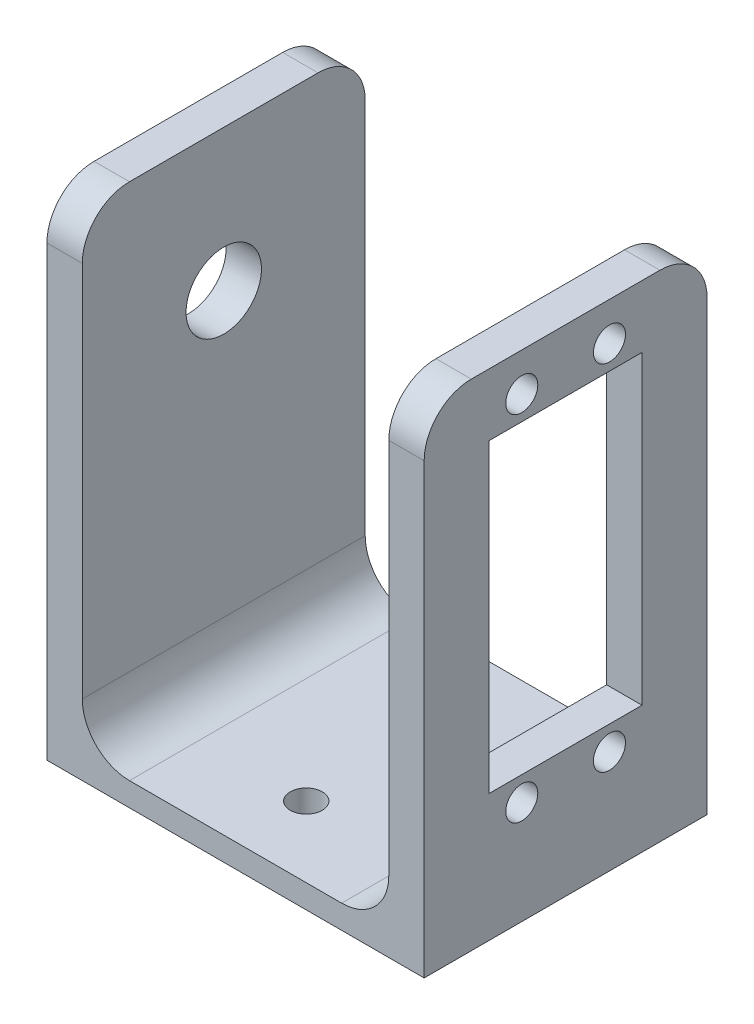
ISO-10303-21;
HEADER;
FILE_DESCRIPTION(('STEP AP214'),'2;1');
FILE_NAME('part.step','',(''),(''),'','','');
FILE_SCHEMA(('AUTOMOTIVE_DESIGN { 1 0 10303 214 1 1 1 1 }'));
ENDSEC;
DATA;
#1=APPLICATION_CONTEXT('core data for automotive mechanical design processes');
#2=APPLICATION_PROTOCOL_DEFINITION('international standard','automotive_design',2000,#1);
#3=PRODUCT_CONTEXT('',#1,'mechanical');
#4=PRODUCT('Part','Part','',(#3));
#5=PRODUCT_RELATED_PRODUCT_CATEGORY('part','',(#4));
#6=PRODUCT_DEFINITION_FORMATION('','',#4);
#7=PRODUCT_DEFINITION_CONTEXT('part definition',#1,'design');
#8=PRODUCT_DEFINITION('design','',#6,#7);
#9=PRODUCT_DEFINITION_SHAPE('','',#8);
#10=(LENGTH_UNIT() NAMED_UNIT(*) SI_UNIT(.MILLI.,.METRE.));
#11=(NAMED_UNIT(*) PLANE_ANGLE_UNIT() SI_UNIT($,.RADIAN.));
#12=(NAMED_UNIT(*) SI_UNIT($,.STERADIAN.) SOLID_ANGLE_UNIT());
#13=UNCERTAINTY_MEASURE_WITH_UNIT(LENGTH_MEASURE(1.E-05),#10,'distance_accuracy_value','');
#14=(GEOMETRIC_REPRESENTATION_CONTEXT(3) GLOBAL_UNCERTAINTY_ASSIGNED_CONTEXT((#13)) GLOBAL_UNIT_ASSIGNED_CONTEXT((#10,
#11,#12)) REPRESENTATION_CONTEXT('',''));
#15=CARTESIAN_POINT('',(0.,0.,0.));
#16=DIRECTION('',(0.,0.,1.));
#17=DIRECTION('',(1.,0.,0.));
#18=AXIS2_PLACEMENT_3D('',#15,#16,#17);
#19=CARTESIAN_POINT('',(0.,3.175,0.));
#20=DIRECTION('',(0.,-1.,0.));
#21=DIRECTION('',(0.,0.,-1.));
#22=AXIS2_PLACEMENT_3D('',#19,#20,#21);
#23=PLANE('',#22);
#24=CARTESIAN_POINT('',(25.4,3.175,-28.575));
#25=DIRECTION('',(0.,1.,0.));
#26=DIRECTION('',(0.,0.,1.));
#27=AXIS2_PLACEMENT_3D('',#24,#25,#26);
#28=CIRCLE('',#27,2.159);
#29=CARTESIAN_POINT('',(25.4,3.175,-26.416));
#30=VERTEX_POINT('',#29);
#31=EDGE_CURVE('E628',#30,#30,#28,.T.);
#32=ORIENTED_EDGE('',*,*,#31,.F.);
#33=EDGE_LOOP('',(#32));
#34=FACE_BOUND('',#33,.T.);
#35=CARTESIAN_POINT('',(25.4,3.175,-9.525));
#36=DIRECTION('',(0.,1.,0.));
#37=DIRECTION('',(0.,0.,1.));
#38=AXIS2_PLACEMENT_3D('',#35,#36,#37);
#39=CIRCLE('',#38,2.159);
#40=CARTESIAN_POINT('',(25.4,3.175,-7.366));
#41=VERTEX_POINT('',#40);
#42=EDGE_CURVE('E624',#41,#41,#39,.T.);
#43=ORIENTED_EDGE('',*,*,#42,.F.);
#44=EDGE_LOOP('',(#43));
#45=FACE_BOUND('',#44,.T.);
#46=DIRECTION('',(-1.,0.,0.));
#47=VECTOR('',#46,1.);
#48=CARTESIAN_POINT('',(0.,3.175,-38.1));
#49=LINE('',#48,#47);
#50=CARTESIAN_POINT('',(39.6875,3.175,-38.1));
#51=VERTEX_POINT('',#50);
#52=CARTESIAN_POINT('',(11.1125,3.175,-38.1));
#53=VERTEX_POINT('',#52);
#54=EDGE_CURVE('E224',#51,#53,#49,.T.);
#55=ORIENTED_EDGE('',*,*,#54,.T.);
#56=DIRECTION('',(0.,0.,-1.));
#57=VECTOR('',#56,1.);
#58=CARTESIAN_POINT('',(11.1125,3.175,0.));
#59=LINE('',#58,#57);
#60=CARTESIAN_POINT('',(11.1125,3.175,0.));
#61=VERTEX_POINT('',#60);
#62=EDGE_CURVE('E290',#53,#61,#59,.F.);
#63=ORIENTED_EDGE('',*,*,#62,.T.);
#64=DIRECTION('',(1.,0.,0.));
#65=VECTOR('',#64,1.);
#66=CARTESIAN_POINT('',(0.,3.175,0.));
#67=LINE('',#66,#65);
#68=CARTESIAN_POINT('',(39.6875,3.175,0.));
#69=VERTEX_POINT('',#68);
#70=EDGE_CURVE('E221',#61,#69,#67,.T.);
#71=ORIENTED_EDGE('',*,*,#70,.T.);
#72=DIRECTION('',(0.,0.,1.));
#73=VECTOR('',#72,1.);
#74=CARTESIAN_POINT('',(39.6875,3.175,-38.1));
#75=LINE('',#74,#73);
#76=EDGE_CURVE('E288',#69,#51,#75,.F.);
#77=ORIENTED_EDGE('',*,*,#76,.T.);
#78=EDGE_LOOP('',(#55,#63,#71,#77));
#79=FACE_BOUND('',#78,.T.);
#80=ADVANCED_FACE('F36',(#34,#45,#79),#23,.F.);
#81=CARTESIAN_POINT('',(0.,3.175,0.));
#82=DIRECTION('',(1.,0.,0.));
#83=DIRECTION('',(0.,0.,-1.));
#84=AXIS2_PLACEMENT_3D('',#81,#82,#83);
#85=PLANE('',#84);
#86=CARTESIAN_POINT('',(0.,47.625,-19.05));
#87=DIRECTION('',(-1.,0.,0.));
#88=DIRECTION('',(0.,0.,1.));
#89=AXIS2_PLACEMENT_3D('',#86,#87,#88);
#90=CIRCLE('',#89,5.08);
#91=CARTESIAN_POINT('',(0.,47.625,-13.97));
#92=VERTEX_POINT('',#91);
#93=EDGE_CURVE('E617',#92,#92,#90,.T.);
#94=ORIENTED_EDGE('',*,*,#93,.F.);
#95=EDGE_LOOP('',(#94));
#96=FACE_BOUND('',#95,.T.);
#97=DIRECTION('',(0.,0.,1.));
#98=VECTOR('',#97,1.);
#99=CARTESIAN_POINT('',(0.,66.675,-38.1));
#100=LINE('',#99,#98);
#101=CARTESIAN_POINT('',(0.,66.675,-31.75));
#102=VERTEX_POINT('',#101);
#103=CARTESIAN_POINT('',(0.,66.675,-6.35000000000002));
#104=VERTEX_POINT('',#103);
#105=EDGE_CURVE('E199',#102,#104,#100,.T.);
#106=ORIENTED_EDGE('',*,*,#105,.F.);
#107=CARTESIAN_POINT('',(0.,60.325,-31.75));
#108=DIRECTION('',(1.,0.,0.));
#109=DIRECTION('',(0.,0.,-1.));
#110=AXIS2_PLACEMENT_3D('',#107,#108,#109);
#111=CIRCLE('',#110,6.35);
#112=CARTESIAN_POINT('',(0.,60.325,-38.1));
#113=VERTEX_POINT('',#112);
#114=EDGE_CURVE('E279',#102,#113,#111,.F.);
#115=ORIENTED_EDGE('',*,*,#114,.T.);
#116=DIRECTION('',(0.,-1.,0.));
#117=VECTOR('',#116,1.);
#118=CARTESIAN_POINT('',(0.,3.175,-38.1));
#119=LINE('',#118,#117);
#120=CARTESIAN_POINT('',(0.,0.,-38.1));
#121=VERTEX_POINT('',#120);
#122=EDGE_CURVE('E228',#113,#121,#119,.T.);
#123=ORIENTED_EDGE('',*,*,#122,.T.);
#124=DIRECTION('',(0.,0.,1.));
#125=VECTOR('',#124,1.);
#126=CARTESIAN_POINT('',(0.,0.,0.));
#127=LINE('',#126,#125);
#128=CARTESIAN_POINT('',(0.,0.,0.));
#129=VERTEX_POINT('',#128);
#130=EDGE_CURVE('E220',#121,#129,#127,.T.);
#131=ORIENTED_EDGE('',*,*,#130,.T.);
#132=DIRECTION('',(0.,-1.,0.));
#133=VECTOR('',#132,1.);
#134=CARTESIAN_POINT('',(0.,3.175,0.));
#135=LINE('',#134,#133);
#136=CARTESIAN_POINT('',(0.,60.325,0.));
#137=VERTEX_POINT('',#136);
#138=EDGE_CURVE('E244',#137,#129,#135,.T.);
#139=ORIENTED_EDGE('',*,*,#138,.F.);
#140=CARTESIAN_POINT('',(0.,60.325,-6.35));
#141=DIRECTION('',(1.,0.,0.));
#142=DIRECTION('',(0.,0.,-1.));
#143=AXIS2_PLACEMENT_3D('',#140,#141,#142);
#144=CIRCLE('',#143,6.35);
#145=EDGE_CURVE('E277',#137,#104,#144,.F.);
#146=ORIENTED_EDGE('',*,*,#145,.T.);
#147=EDGE_LOOP('',(#106,#115,#123,#131,#139,#146));
#148=FACE_BOUND('',#147,.T.);
#149=ADVANCED_FACE('F335',(#96,#148),#85,.F.);
#150=CARTESIAN_POINT('',(0.,3.175,0.));
#151=DIRECTION('',(0.,0.,-1.));
#152=DIRECTION('',(-1.,0.,0.));
#153=AXIS2_PLACEMENT_3D('',#150,#151,#152);
#154=PLANE('',#153);
#155=DIRECTION('',(0.,-1.,0.));
#156=VECTOR('',#155,1.);
#157=CARTESIAN_POINT('',(50.8,3.175,0.));
#158=LINE('',#157,#156);
#159=CARTESIAN_POINT('',(50.8,60.325,0.));
#160=VERTEX_POINT('',#159);
#161=CARTESIAN_POINT('',(50.8,0.,0.));
#162=VERTEX_POINT('',#161);
#163=EDGE_CURVE('E242',#160,#162,#158,.T.);
#164=ORIENTED_EDGE('',*,*,#163,.F.);
#165=DIRECTION('',(1.,0.,0.));
#166=VECTOR('',#165,1.);
#167=CARTESIAN_POINT('',(0.,60.325,0.));
#168=LINE('',#167,#166);
#169=CARTESIAN_POINT('',(46.0375,60.325,0.));
#170=VERTEX_POINT('',#169);
#171=EDGE_CURVE('E258',#160,#170,#168,.F.);
#172=ORIENTED_EDGE('',*,*,#171,.T.);
#173=DIRECTION('',(0.,-1.,0.));
#174=VECTOR('',#173,1.);
#175=CARTESIAN_POINT('',(46.0375,66.675,0.));
#176=LINE('',#175,#174);
#177=CARTESIAN_POINT('',(46.0375,9.525,0.));
#178=VERTEX_POINT('',#177);
#179=EDGE_CURVE('E214',#170,#178,#176,.T.);
#180=ORIENTED_EDGE('',*,*,#179,.T.);
#181=CARTESIAN_POINT('',(39.6875,9.525,0.));
#182=DIRECTION('',(0.,0.,-1.));
#183=DIRECTION('',(-1.,0.,0.));
#184=AXIS2_PLACEMENT_3D('',#181,#182,#183);
#185=CIRCLE('',#184,6.35);
#186=EDGE_CURVE('E44',#178,#69,#185,.T.);
#187=ORIENTED_EDGE('',*,*,#186,.T.);
#188=ORIENTED_EDGE('',*,*,#70,.F.);
#189=CARTESIAN_POINT('',(11.1125,9.525,0.));
#190=DIRECTION('',(0.,0.,-1.));
#191=DIRECTION('',(-1.,0.,0.));
#192=AXIS2_PLACEMENT_3D('',#189,#190,#191);
#193=CIRCLE('',#192,6.35);
#194=CARTESIAN_POINT('',(4.76250000000001,9.525,0.));
#195=VERTEX_POINT('',#194);
#196=EDGE_CURVE('E294',#61,#195,#193,.T.);
#197=ORIENTED_EDGE('',*,*,#196,.T.);
#198=DIRECTION('',(0.,-1.,0.));
#199=VECTOR('',#198,1.);
#200=CARTESIAN_POINT('',(4.76250000000001,66.675,0.));
#201=LINE('',#200,#199);
#202=CARTESIAN_POINT('',(4.76250000000001,60.325,0.));
#203=VERTEX_POINT('',#202);
#204=EDGE_CURVE('E202',#203,#195,#201,.T.);
#205=ORIENTED_EDGE('',*,*,#204,.F.);
#206=DIRECTION('',(1.,0.,0.));
#207=VECTOR('',#206,1.);
#208=CARTESIAN_POINT('',(0.,60.325,0.));
#209=LINE('',#208,#207);
#210=EDGE_CURVE('E256',#203,#137,#209,.F.);
#211=ORIENTED_EDGE('',*,*,#210,.T.);
#212=ORIENTED_EDGE('',*,*,#138,.T.);
#213=DIRECTION('',(1.,0.,0.));
#214=VECTOR('',#213,1.);
#215=CARTESIAN_POINT('',(0.,0.,0.));
#216=LINE('',#215,#214);
#217=EDGE_CURVE('E231',#129,#162,#216,.T.);
#218=ORIENTED_EDGE('',*,*,#217,.T.);
#219=EDGE_LOOP('',(#164,#172,#180,#187,#188,#197,#205,#211,#212,#218));
#220=FACE_BOUND('',#219,.T.);
#221=ADVANCED_FACE('F298',(#220),#154,.F.);
#222=CARTESIAN_POINT('',(50.8,3.175,0.));
#223=DIRECTION('',(-1.,0.,0.));
#224=DIRECTION('',(0.,0.,1.));
#225=AXIS2_PLACEMENT_3D('',#222,#223,#224);
#226=PLANE('',#225);
#227=CARTESIAN_POINT('',(50.8,13.9065,-24.9555));
#228=DIRECTION('',(1.,0.,0.));
#229=DIRECTION('',(0.,0.,-1.));
#230=AXIS2_PLACEMENT_3D('',#227,#228,#229);
#231=CIRCLE('',#230,2.159);
#232=CARTESIAN_POINT('',(50.8,13.9065,-27.1145));
#233=VERTEX_POINT('',#232);
#234=EDGE_CURVE('E631',#233,#233,#231,.T.);
#235=ORIENTED_EDGE('',*,*,#234,.F.);
#236=EDGE_LOOP('',(#235));
#237=FACE_BOUND('',#236,.T.);
#238=CARTESIAN_POINT('',(50.8,13.9065,-13.1445));
#239=DIRECTION('',(1.,0.,0.));
#240=DIRECTION('',(0.,0.,-1.));
#241=AXIS2_PLACEMENT_3D('',#238,#239,#240);
#242=CIRCLE('',#241,2.159);
#243=CARTESIAN_POINT('',(50.8,13.9065,-15.3035));
#244=VERTEX_POINT('',#243);
#245=EDGE_CURVE('E650',#244,#244,#242,.T.);
#246=ORIENTED_EDGE('',*,*,#245,.F.);
#247=EDGE_LOOP('',(#246));
#248=FACE_BOUND('',#247,.T.);
#249=CARTESIAN_POINT('',(50.8,61.5315,-13.1445));
#250=DIRECTION('',(1.,0.,0.));
#251=DIRECTION('',(0.,0.,-1.));
#252=AXIS2_PLACEMENT_3D('',#249,#250,#251);
#253=CIRCLE('',#252,2.15899999999999);
#254=CARTESIAN_POINT('',(50.8,61.5315,-15.3035));
#255=VERTEX_POINT('',#254);
#256=EDGE_CURVE('E644',#255,#255,#253,.T.);
#257=ORIENTED_EDGE('',*,*,#256,.F.);
#258=EDGE_LOOP('',(#257));
#259=FACE_BOUND('',#258,.T.);
#260=CARTESIAN_POINT('',(50.8,61.5315,-24.9555));
#261=DIRECTION('',(1.,0.,0.));
#262=DIRECTION('',(0.,0.,-1.));
#263=AXIS2_PLACEMENT_3D('',#260,#261,#262);
#264=CIRCLE('',#263,2.15899999999999);
#265=CARTESIAN_POINT('',(50.8,61.5315,-27.1145));
#266=VERTEX_POINT('',#265);
#267=EDGE_CURVE('E637',#266,#266,#264,.T.);
#268=ORIENTED_EDGE('',*,*,#267,.F.);
#269=EDGE_LOOP('',(#268));
#270=FACE_BOUND('',#269,.T.);
#271=DIRECTION('',(0.,0.,-1.));
#272=VECTOR('',#271,1.);
#273=CARTESIAN_POINT('',(50.8,17.145,-8.76300000000001));
#274=LINE('',#273,#272);
#275=CARTESIAN_POINT('',(50.8,17.145,-8.76300000000001));
#276=VERTEX_POINT('',#275);
#277=CARTESIAN_POINT('',(50.8,17.145,-29.337));
#278=VERTEX_POINT('',#277);
#279=EDGE_CURVE('E182',#276,#278,#274,.T.);
#280=ORIENTED_EDGE('',*,*,#279,.F.);
#281=DIRECTION('',(0.,-1.,0.));
#282=VECTOR('',#281,1.);
#283=CARTESIAN_POINT('',(50.8,58.293,-8.763));
#284=LINE('',#283,#282);
#285=CARTESIAN_POINT('',(50.8,58.293,-8.763));
#286=VERTEX_POINT('',#285);
#287=EDGE_CURVE('E51',#286,#276,#284,.T.);
#288=ORIENTED_EDGE('',*,*,#287,.F.);
#289=DIRECTION('',(0.,0.,1.));
#290=VECTOR('',#289,1.);
#291=CARTESIAN_POINT('',(50.8,58.293,-8.763));
#292=LINE('',#291,#290);
#293=CARTESIAN_POINT('',(50.8,58.293,-29.337));
#294=VERTEX_POINT('',#293);
#295=EDGE_CURVE('E168',#294,#286,#292,.T.);
#296=ORIENTED_EDGE('',*,*,#295,.F.);
#297=DIRECTION('',(0.,1.,0.));
#298=VECTOR('',#297,1.);
#299=CARTESIAN_POINT('',(50.8,58.293,-29.337));
#300=LINE('',#299,#298);
#301=EDGE_CURVE('E188',#278,#294,#300,.T.);
#302=ORIENTED_EDGE('',*,*,#301,.F.);
#303=EDGE_LOOP('',(#280,#288,#296,#302));
#304=FACE_BOUND('',#303,.T.);
#305=DIRECTION('',(0.,0.,-1.));
#306=VECTOR('',#305,1.);
#307=CARTESIAN_POINT('',(50.8,66.675,-38.1));
#308=LINE('',#307,#306);
#309=CARTESIAN_POINT('',(50.8,66.675,-6.35000000000002));
#310=VERTEX_POINT('',#309);
#311=CARTESIAN_POINT('',(50.8,66.675,-31.75));
#312=VERTEX_POINT('',#311);
#313=EDGE_CURVE('E208',#310,#312,#308,.T.);
#314=ORIENTED_EDGE('',*,*,#313,.F.);
#315=CARTESIAN_POINT('',(50.8,60.325,-6.35));
#316=DIRECTION('',(-1.,0.,0.));
#317=DIRECTION('',(0.,0.,1.));
#318=AXIS2_PLACEMENT_3D('',#315,#316,#317);
#319=CIRCLE('',#318,6.35);
#320=EDGE_CURVE('E254',#310,#160,#319,.F.);
#321=ORIENTED_EDGE('',*,*,#320,.T.);
#322=ORIENTED_EDGE('',*,*,#163,.T.);
#323=DIRECTION('',(0.,0.,-1.));
#324=VECTOR('',#323,1.);
#325=CARTESIAN_POINT('',(50.8,0.,0.));
#326=LINE('',#325,#324);
#327=CARTESIAN_POINT('',(50.8,0.,-38.1));
#328=VERTEX_POINT('',#327);
#329=EDGE_CURVE('E234',#162,#328,#326,.T.);
#330=ORIENTED_EDGE('',*,*,#329,.T.);
#331=DIRECTION('',(0.,-1.,0.));
#332=VECTOR('',#331,1.);
#333=CARTESIAN_POINT('',(50.8,3.175,-38.1));
#334=LINE('',#333,#332);
#335=CARTESIAN_POINT('',(50.8,60.325,-38.1));
#336=VERTEX_POINT('',#335);
#337=EDGE_CURVE('E240',#336,#328,#334,.T.);
#338=ORIENTED_EDGE('',*,*,#337,.F.);
#339=CARTESIAN_POINT('',(50.8,60.325,-31.75));
#340=DIRECTION('',(-1.,0.,0.));
#341=DIRECTION('',(0.,0.,1.));
#342=AXIS2_PLACEMENT_3D('',#339,#340,#341);
#343=CIRCLE('',#342,6.35);
#344=EDGE_CURVE('E252',#336,#312,#343,.F.);
#345=ORIENTED_EDGE('',*,*,#344,.T.);
#346=EDGE_LOOP('',(#314,#321,#322,#330,#338,#345));
#347=FACE_BOUND('',#346,.T.);
#348=ADVANCED_FACE('F322',(#237,#248,#259,#270,#304,#347),#226,.F.);
#349=CARTESIAN_POINT('',(0.,3.175,-38.1));
#350=DIRECTION('',(0.,0.,1.));
#351=DIRECTION('',(1.,0.,0.));
#352=AXIS2_PLACEMENT_3D('',#349,#350,#351);
#353=PLANE('',#352);
#354=DIRECTION('',(0.,-1.,0.));
#355=VECTOR('',#354,1.);
#356=CARTESIAN_POINT('',(46.0375,66.675,-38.1));
#357=LINE('',#356,#355);
#358=CARTESIAN_POINT('',(46.0375,60.325,-38.1));
#359=VERTEX_POINT('',#358);
#360=CARTESIAN_POINT('',(46.0375,9.525,-38.1));
#361=VERTEX_POINT('',#360);
#362=EDGE_CURVE('E217',#359,#361,#357,.T.);
#363=ORIENTED_EDGE('',*,*,#362,.F.);
#364=DIRECTION('',(-1.,0.,0.));
#365=VECTOR('',#364,1.);
#366=CARTESIAN_POINT('',(0.,60.325,-38.1));
#367=LINE('',#366,#365);
#368=EDGE_CURVE('E269',#359,#336,#367,.F.);
#369=ORIENTED_EDGE('',*,*,#368,.T.);
#370=ORIENTED_EDGE('',*,*,#337,.T.);
#371=DIRECTION('',(-1.,0.,0.));
#372=VECTOR('',#371,1.);
#373=CARTESIAN_POINT('',(0.,0.,-38.1));
#374=LINE('',#373,#372);
#375=EDGE_CURVE('E225',#328,#121,#374,.T.);
#376=ORIENTED_EDGE('',*,*,#375,.T.);
#377=ORIENTED_EDGE('',*,*,#122,.F.);
#378=DIRECTION('',(-1.,0.,0.));
#379=VECTOR('',#378,1.);
#380=CARTESIAN_POINT('',(0.,60.325,-38.1));
#381=LINE('',#380,#379);
#382=CARTESIAN_POINT('',(4.7625,60.325,-38.1));
#383=VERTEX_POINT('',#382);
#384=EDGE_CURVE('E267',#113,#383,#381,.F.);
#385=ORIENTED_EDGE('',*,*,#384,.T.);
#386=DIRECTION('',(0.,-1.,0.));
#387=VECTOR('',#386,1.);
#388=CARTESIAN_POINT('',(4.7625,66.675,-38.1));
#389=LINE('',#388,#387);
#390=CARTESIAN_POINT('',(4.7625,9.525,-38.1));
#391=VERTEX_POINT('',#390);
#392=EDGE_CURVE('E205',#383,#391,#389,.T.);
#393=ORIENTED_EDGE('',*,*,#392,.T.);
#394=CARTESIAN_POINT('',(11.1125,9.525,-38.1));
#395=DIRECTION('',(0.,0.,1.));
#396=DIRECTION('',(1.,0.,0.));
#397=AXIS2_PLACEMENT_3D('',#394,#395,#396);
#398=CIRCLE('',#397,6.35);
#399=EDGE_CURVE('E292',#391,#53,#398,.T.);
#400=ORIENTED_EDGE('',*,*,#399,.T.);
#401=ORIENTED_EDGE('',*,*,#54,.F.);
#402=CARTESIAN_POINT('',(39.6875,9.525,-38.1));
#403=DIRECTION('',(0.,0.,1.));
#404=DIRECTION('',(1.,0.,0.));
#405=AXIS2_PLACEMENT_3D('',#402,#403,#404);
#406=CIRCLE('',#405,6.35);
#407=EDGE_CURVE('E11',#51,#361,#406,.T.);
#408=ORIENTED_EDGE('',*,*,#407,.T.);
#409=EDGE_LOOP('',(#363,#369,#370,#376,#377,#385,#393,#400,#401,#408));
#410=FACE_BOUND('',#409,.T.);
#411=ADVANCED_FACE('F310',(#410),#353,.F.);
#412=CARTESIAN_POINT('',(0.,0.,0.));
#413=DIRECTION('',(0.,-1.,0.));
#414=DIRECTION('',(0.,0.,-1.));
#415=AXIS2_PLACEMENT_3D('',#412,#413,#414);
#416=PLANE('',#415);
#417=CARTESIAN_POINT('',(25.4,0.,-28.575));
#418=DIRECTION('',(0.,-1.,0.));
#419=DIRECTION('',(0.,0.,-1.));
#420=AXIS2_PLACEMENT_3D('',#417,#418,#419);
#421=CIRCLE('',#420,2.159);
#422=CARTESIAN_POINT('',(25.4,0.,-30.734));
#423=VERTEX_POINT('',#422);
#424=EDGE_CURVE('E632',#423,#423,#421,.F.);
#425=ORIENTED_EDGE('',*,*,#424,.T.);
#426=EDGE_LOOP('',(#425));
#427=FACE_BOUND('',#426,.T.);
#428=CARTESIAN_POINT('',(25.4,0.,-9.525));
#429=DIRECTION('',(0.,-1.,0.));
#430=DIRECTION('',(0.,0.,-1.));
#431=AXIS2_PLACEMENT_3D('',#428,#429,#430);
#432=CIRCLE('',#431,2.159);
#433=CARTESIAN_POINT('',(25.4,0.,-11.684));
#434=VERTEX_POINT('',#433);
#435=EDGE_CURVE('E621',#434,#434,#432,.F.);
#436=ORIENTED_EDGE('',*,*,#435,.T.);
#437=EDGE_LOOP('',(#436));
#438=FACE_BOUND('',#437,.T.);
#439=ORIENTED_EDGE('',*,*,#130,.F.);
#440=ORIENTED_EDGE('',*,*,#375,.F.);
#441=ORIENTED_EDGE('',*,*,#329,.F.);
#442=ORIENTED_EDGE('',*,*,#217,.F.);
#443=EDGE_LOOP('',(#439,#440,#441,#442));
#444=FACE_BOUND('',#443,.T.);
#445=ADVANCED_FACE('F331',(#427,#438,#444),#416,.T.);
#446=CARTESIAN_POINT('',(46.0375,66.675,-38.1));
#447=DIRECTION('',(1.,0.,0.));
#448=DIRECTION('',(0.,0.,-1.));
#449=AXIS2_PLACEMENT_3D('',#446,#447,#448);
#450=PLANE('',#449);
#451=CARTESIAN_POINT('',(46.0375,13.9065,-24.9555));
#452=DIRECTION('',(1.,0.,0.));
#453=DIRECTION('',(0.,0.,-1.));
#454=AXIS2_PLACEMENT_3D('',#451,#452,#453);
#455=CIRCLE('',#454,2.159);
#456=CARTESIAN_POINT('',(46.0375,13.9065,-27.1145));
#457=VERTEX_POINT('',#456);
#458=EDGE_CURVE('E653',#457,#457,#455,.F.);
#459=ORIENTED_EDGE('',*,*,#458,.F.);
#460=EDGE_LOOP('',(#459));
#461=FACE_BOUND('',#460,.T.);
#462=CARTESIAN_POINT('',(46.0375,13.9065,-13.1445));
#463=DIRECTION('',(1.,0.,0.));
#464=DIRECTION('',(0.,0.,-1.));
#465=AXIS2_PLACEMENT_3D('',#462,#463,#464);
#466=CIRCLE('',#465,2.159);
#467=CARTESIAN_POINT('',(46.0375,13.9065,-15.3035));
#468=VERTEX_POINT('',#467);
#469=EDGE_CURVE('E647',#468,#468,#466,.F.);
#470=ORIENTED_EDGE('',*,*,#469,.F.);
#471=EDGE_LOOP('',(#470));
#472=FACE_BOUND('',#471,.T.);
#473=CARTESIAN_POINT('',(46.0375,61.5315,-13.1445));
#474=DIRECTION('',(1.,0.,0.));
#475=DIRECTION('',(0.,0.,-1.));
#476=AXIS2_PLACEMENT_3D('',#473,#474,#475);
#477=CIRCLE('',#476,2.15899999999999);
#478=CARTESIAN_POINT('',(46.0375,61.5315,-15.3035));
#479=VERTEX_POINT('',#478);
#480=EDGE_CURVE('E641',#479,#479,#477,.F.);
#481=ORIENTED_EDGE('',*,*,#480,.F.);
#482=EDGE_LOOP('',(#481));
#483=FACE_BOUND('',#482,.T.);
#484=CARTESIAN_POINT('',(46.0375,61.5315,-24.9555));
#485=DIRECTION('',(1.,0.,0.));
#486=DIRECTION('',(0.,0.,-1.));
#487=AXIS2_PLACEMENT_3D('',#484,#485,#486);
#488=CIRCLE('',#487,2.15899999999999);
#489=CARTESIAN_POINT('',(46.0375,61.5315,-27.1145));
#490=VERTEX_POINT('',#489);
#491=EDGE_CURVE('E640',#490,#490,#488,.F.);
#492=ORIENTED_EDGE('',*,*,#491,.F.);
#493=EDGE_LOOP('',(#492));
#494=FACE_BOUND('',#493,.T.);
#495=DIRECTION('',(0.,0.,-1.));
#496=VECTOR('',#495,1.);
#497=CARTESIAN_POINT('',(46.0375,58.293,-8.76300000000001));
#498=LINE('',#497,#496);
#499=CARTESIAN_POINT('',(46.0375,58.293,-8.763));
#500=VERTEX_POINT('',#499);
#501=CARTESIAN_POINT('',(46.0375,58.293,-29.337));
#502=VERTEX_POINT('',#501);
#503=EDGE_CURVE('E180',#500,#502,#498,.T.);
#504=ORIENTED_EDGE('',*,*,#503,.F.);
#505=DIRECTION('',(0.,1.,0.));
#506=VECTOR('',#505,1.);
#507=CARTESIAN_POINT('',(46.0375,58.293,-8.763));
#508=LINE('',#507,#506);
#509=CARTESIAN_POINT('',(46.0375,17.145,-8.76300000000001));
#510=VERTEX_POINT('',#509);
#511=EDGE_CURVE('E162',#510,#500,#508,.T.);
#512=ORIENTED_EDGE('',*,*,#511,.F.);
#513=DIRECTION('',(0.,0.,1.));
#514=VECTOR('',#513,1.);
#515=CARTESIAN_POINT('',(46.0375,17.145,-8.76300000000002));
#516=LINE('',#515,#514);
#517=CARTESIAN_POINT('',(46.0375,17.145,-29.337));
#518=VERTEX_POINT('',#517);
#519=EDGE_CURVE('E171',#518,#510,#516,.T.);
#520=ORIENTED_EDGE('',*,*,#519,.F.);
#521=DIRECTION('',(0.,-1.,0.));
#522=VECTOR('',#521,1.);
#523=CARTESIAN_POINT('',(46.0375,58.293,-29.337));
#524=LINE('',#523,#522);
#525=EDGE_CURVE('E59',#502,#518,#524,.T.);
#526=ORIENTED_EDGE('',*,*,#525,.F.);
#527=EDGE_LOOP('',(#504,#512,#520,#526));
#528=FACE_BOUND('',#527,.T.);
#529=ORIENTED_EDGE('',*,*,#179,.F.);
#530=CARTESIAN_POINT('',(46.0375,60.325,-6.35));
#531=DIRECTION('',(1.,0.,0.));
#532=DIRECTION('',(0.,0.,-1.));
#533=AXIS2_PLACEMENT_3D('',#530,#531,#532);
#534=CIRCLE('',#533,6.35);
#535=CARTESIAN_POINT('',(46.0375,66.675,-6.35000000000002));
#536=VERTEX_POINT('',#535);
#537=EDGE_CURVE('E265',#170,#536,#534,.F.);
#538=ORIENTED_EDGE('',*,*,#537,.T.);
#539=DIRECTION('',(0.,0.,1.));
#540=VECTOR('',#539,1.);
#541=CARTESIAN_POINT('',(46.0375,66.675,-38.1));
#542=LINE('',#541,#540);
#543=CARTESIAN_POINT('',(46.0375,66.675,-31.75));
#544=VERTEX_POINT('',#543);
#545=EDGE_CURVE('E211',#544,#536,#542,.T.);
#546=ORIENTED_EDGE('',*,*,#545,.F.);
#547=CARTESIAN_POINT('',(46.0375,60.325,-31.75));
#548=DIRECTION('',(1.,0.,0.));
#549=DIRECTION('',(0.,0.,-1.));
#550=AXIS2_PLACEMENT_3D('',#547,#548,#549);
#551=CIRCLE('',#550,6.35);
#552=EDGE_CURVE('E263',#544,#359,#551,.F.);
#553=ORIENTED_EDGE('',*,*,#552,.T.);
#554=ORIENTED_EDGE('',*,*,#362,.T.);
#555=DIRECTION('',(0.,0.,1.));
#556=VECTOR('',#555,1.);
#557=CARTESIAN_POINT('',(46.0375,9.525,0.));
#558=LINE('',#557,#556);
#559=EDGE_CURVE('E260',#361,#178,#558,.T.);
#560=ORIENTED_EDGE('',*,*,#559,.T.);
#561=EDGE_LOOP('',(#529,#538,#546,#553,#554,#560));
#562=FACE_BOUND('',#561,.T.);
#563=ADVANCED_FACE('F177',(#461,#472,#483,#494,#528,#562),#450,.F.);
#564=CARTESIAN_POINT('',(0.,66.675,0.));
#565=DIRECTION('',(0.,-1.,0.));
#566=DIRECTION('',(0.,0.,-1.));
#567=AXIS2_PLACEMENT_3D('',#564,#565,#566);
#568=PLANE('',#567);
#569=ORIENTED_EDGE('',*,*,#545,.T.);
#570=DIRECTION('',(1.,0.,0.));
#571=VECTOR('',#570,1.);
#572=CARTESIAN_POINT('',(0.,66.675,-6.35));
#573=LINE('',#572,#571);
#574=EDGE_CURVE('E249',#536,#310,#573,.T.);
#575=ORIENTED_EDGE('',*,*,#574,.T.);
#576=ORIENTED_EDGE('',*,*,#313,.T.);
#577=DIRECTION('',(-1.,0.,0.));
#578=VECTOR('',#577,1.);
#579=CARTESIAN_POINT('',(0.,66.675,-31.75));
#580=LINE('',#579,#578);
#581=EDGE_CURVE('E246',#312,#544,#580,.T.);
#582=ORIENTED_EDGE('',*,*,#581,.T.);
#583=EDGE_LOOP('',(#569,#575,#576,#582));
#584=FACE_BOUND('',#583,.T.);
#585=ADVANCED_FACE('F318',(#584),#568,.F.);
#586=CARTESIAN_POINT('',(4.7625,66.675,-38.1));
#587=DIRECTION('',(-1.,0.,0.));
#588=DIRECTION('',(0.,0.,1.));
#589=AXIS2_PLACEMENT_3D('',#586,#587,#588);
#590=PLANE('',#589);
#591=CARTESIAN_POINT('',(4.7625,47.625,-19.05));
#592=DIRECTION('',(-1.,0.,0.));
#593=DIRECTION('',(0.,0.,1.));
#594=AXIS2_PLACEMENT_3D('',#591,#592,#593);
#595=CIRCLE('',#594,5.08);
#596=CARTESIAN_POINT('',(4.7625,47.625,-13.97));
#597=VERTEX_POINT('',#596);
#598=EDGE_CURVE('E620',#597,#597,#595,.F.);
#599=ORIENTED_EDGE('',*,*,#598,.F.);
#600=EDGE_LOOP('',(#599));
#601=FACE_BOUND('',#600,.T.);
#602=ORIENTED_EDGE('',*,*,#392,.F.);
#603=CARTESIAN_POINT('',(4.7625,60.325,-31.75));
#604=DIRECTION('',(-1.,0.,0.));
#605=DIRECTION('',(0.,0.,1.));
#606=AXIS2_PLACEMENT_3D('',#603,#604,#605);
#607=CIRCLE('',#606,6.35);
#608=CARTESIAN_POINT('',(4.7625,66.675,-31.75));
#609=VERTEX_POINT('',#608);
#610=EDGE_CURVE('E286',#383,#609,#607,.F.);
#611=ORIENTED_EDGE('',*,*,#610,.T.);
#612=DIRECTION('',(0.,0.,-1.));
#613=VECTOR('',#612,1.);
#614=CARTESIAN_POINT('',(4.7625,66.675,-38.1));
#615=LINE('',#614,#613);
#616=CARTESIAN_POINT('',(4.76250000000001,66.675,-6.35000000000002));
#617=VERTEX_POINT('',#616);
#618=EDGE_CURVE('E174',#617,#609,#615,.T.);
#619=ORIENTED_EDGE('',*,*,#618,.F.);
#620=CARTESIAN_POINT('',(4.76250000000001,60.325,-6.35));
#621=DIRECTION('',(-1.,0.,0.));
#622=DIRECTION('',(0.,0.,1.));
#623=AXIS2_PLACEMENT_3D('',#620,#621,#622);
#624=CIRCLE('',#623,6.35);
#625=EDGE_CURVE('E284',#617,#203,#624,.F.);
#626=ORIENTED_EDGE('',*,*,#625,.T.);
#627=ORIENTED_EDGE('',*,*,#204,.T.);
#628=DIRECTION('',(0.,0.,-1.));
#629=VECTOR('',#628,1.);
#630=CARTESIAN_POINT('',(4.7625,9.525,-38.1));
#631=LINE('',#630,#629);
#632=EDGE_CURVE('E281',#195,#391,#631,.T.);
#633=ORIENTED_EDGE('',*,*,#632,.T.);
#634=EDGE_LOOP('',(#602,#611,#619,#626,#627,#633));
#635=FACE_BOUND('',#634,.T.);
#636=ADVANCED_FACE('F347',(#601,#635),#590,.F.);
#637=CARTESIAN_POINT('',(0.,66.675,0.));
#638=DIRECTION('',(0.,-1.,0.));
#639=DIRECTION('',(0.,0.,-1.));
#640=AXIS2_PLACEMENT_3D('',#637,#638,#639);
#641=PLANE('',#640);
#642=ORIENTED_EDGE('',*,*,#618,.T.);
#643=DIRECTION('',(-1.,0.,0.));
#644=VECTOR('',#643,1.);
#645=CARTESIAN_POINT('',(0.,66.675,-31.75));
#646=LINE('',#645,#644);
#647=EDGE_CURVE('E274',#609,#102,#646,.T.);
#648=ORIENTED_EDGE('',*,*,#647,.T.);
#649=ORIENTED_EDGE('',*,*,#105,.T.);
#650=DIRECTION('',(1.,0.,0.));
#651=VECTOR('',#650,1.);
#652=CARTESIAN_POINT('',(0.,66.675,-6.35));
#653=LINE('',#652,#651);
#654=EDGE_CURVE('E271',#104,#617,#653,.T.);
#655=ORIENTED_EDGE('',*,*,#654,.T.);
#656=EDGE_LOOP('',(#642,#648,#649,#655));
#657=FACE_BOUND('',#656,.T.);
#658=ADVANCED_FACE('F342',(#657),#641,.F.);
#659=CARTESIAN_POINT('',(0.,60.325,-6.35));
#660=DIRECTION('',(1.,0.,0.));
#661=DIRECTION('',(0.,0.,-1.));
#662=AXIS2_PLACEMENT_3D('',#659,#660,#661);
#663=CYLINDRICAL_SURFACE('',#662,6.35);
#664=ORIENTED_EDGE('',*,*,#537,.F.);
#665=ORIENTED_EDGE('',*,*,#171,.F.);
#666=ORIENTED_EDGE('',*,*,#320,.F.);
#667=ORIENTED_EDGE('',*,*,#574,.F.);
#668=EDGE_LOOP('',(#664,#665,#666,#667));
#669=FACE_BOUND('',#668,.T.);
#670=ADVANCED_FACE('F385',(#669),#663,.T.);
#671=CARTESIAN_POINT('',(0.,60.325,-31.75));
#672=DIRECTION('',(-1.,0.,0.));
#673=DIRECTION('',(0.,0.,1.));
#674=AXIS2_PLACEMENT_3D('',#671,#672,#673);
#675=CYLINDRICAL_SURFACE('',#674,6.35);
#676=ORIENTED_EDGE('',*,*,#344,.F.);
#677=ORIENTED_EDGE('',*,*,#368,.F.);
#678=ORIENTED_EDGE('',*,*,#552,.F.);
#679=ORIENTED_EDGE('',*,*,#581,.F.);
#680=EDGE_LOOP('',(#676,#677,#678,#679));
#681=FACE_BOUND('',#680,.T.);
#682=ADVANCED_FACE('F316',(#681),#675,.T.);
#683=CARTESIAN_POINT('',(0.,60.325,-31.75));
#684=DIRECTION('',(-1.,0.,0.));
#685=DIRECTION('',(0.,0.,1.));
#686=AXIS2_PLACEMENT_3D('',#683,#684,#685);
#687=CYLINDRICAL_SURFACE('',#686,6.35);
#688=ORIENTED_EDGE('',*,*,#610,.F.);
#689=ORIENTED_EDGE('',*,*,#384,.F.);
#690=ORIENTED_EDGE('',*,*,#114,.F.);
#691=ORIENTED_EDGE('',*,*,#647,.F.);
#692=EDGE_LOOP('',(#688,#689,#690,#691));
#693=FACE_BOUND('',#692,.T.);
#694=ADVANCED_FACE('F340',(#693),#687,.T.);
#695=CARTESIAN_POINT('',(0.,60.325,-6.35));
#696=DIRECTION('',(1.,0.,0.));
#697=DIRECTION('',(0.,0.,-1.));
#698=AXIS2_PLACEMENT_3D('',#695,#696,#697);
#699=CYLINDRICAL_SURFACE('',#698,6.35);
#700=ORIENTED_EDGE('',*,*,#145,.F.);
#701=ORIENTED_EDGE('',*,*,#210,.F.);
#702=ORIENTED_EDGE('',*,*,#625,.F.);
#703=ORIENTED_EDGE('',*,*,#654,.F.);
#704=EDGE_LOOP('',(#700,#701,#702,#703));
#705=FACE_BOUND('',#704,.T.);
#706=ADVANCED_FACE('F354',(#705),#699,.T.);
#707=CARTESIAN_POINT('',(11.1125,9.525,-38.1));
#708=DIRECTION('',(0.,0.,1.));
#709=DIRECTION('',(1.,0.,0.));
#710=AXIS2_PLACEMENT_3D('',#707,#708,#709);
#711=CYLINDRICAL_SURFACE('',#710,6.35);
#712=ORIENTED_EDGE('',*,*,#196,.F.);
#713=ORIENTED_EDGE('',*,*,#62,.F.);
#714=ORIENTED_EDGE('',*,*,#399,.F.);
#715=ORIENTED_EDGE('',*,*,#632,.F.);
#716=EDGE_LOOP('',(#712,#713,#714,#715));
#717=FACE_BOUND('',#716,.T.);
#718=ADVANCED_FACE('F351',(#717),#711,.F.);
#719=CARTESIAN_POINT('',(39.6875,9.525,-38.1));
#720=DIRECTION('',(0.,0.,-1.));
#721=DIRECTION('',(-1.,0.,0.));
#722=AXIS2_PLACEMENT_3D('',#719,#720,#721);
#723=CYLINDRICAL_SURFACE('',#722,6.35);
#724=ORIENTED_EDGE('',*,*,#407,.F.);
#725=ORIENTED_EDGE('',*,*,#76,.F.);
#726=ORIENTED_EDGE('',*,*,#186,.F.);
#727=ORIENTED_EDGE('',*,*,#559,.F.);
#728=EDGE_LOOP('',(#724,#725,#726,#727));
#729=FACE_BOUND('',#728,.T.);
#730=ADVANCED_FACE('F38',(#729),#723,.F.);
#731=CARTESIAN_POINT('',(-0.001000000000001,58.293,-8.763));
#732=DIRECTION('',(0.,0.,1.));
#733=DIRECTION('',(0.,-1.,0.));
#734=AXIS2_PLACEMENT_3D('',#731,#732,#733);
#735=PLANE('',#734);
#736=ORIENTED_EDGE('',*,*,#511,.T.);
#737=DIRECTION('',(1.,0.,0.));
#738=VECTOR('',#737,1.);
#739=CARTESIAN_POINT('',(-0.001000000000001,58.293,-8.763));
#740=LINE('',#739,#738);
#741=EDGE_CURVE('E175',#500,#286,#740,.T.);
#742=ORIENTED_EDGE('',*,*,#741,.T.);
#743=ORIENTED_EDGE('',*,*,#287,.T.);
#744=DIRECTION('',(1.,0.,0.));
#745=VECTOR('',#744,1.);
#746=CARTESIAN_POINT('',(-0.001000000000001,17.145,-8.76300000000001));
#747=LINE('',#746,#745);
#748=EDGE_CURVE('E158',#510,#276,#747,.T.);
#749=ORIENTED_EDGE('',*,*,#748,.F.);
#750=EDGE_LOOP('',(#736,#742,#743,#749));
#751=FACE_BOUND('',#750,.T.);
#752=ADVANCED_FACE('F160',(#751),#735,.F.);
#753=CARTESIAN_POINT('',(-0.001000000000001,58.293,-8.763));
#754=DIRECTION('',(0.,1.,0.));
#755=DIRECTION('',(0.,0.,1.));
#756=AXIS2_PLACEMENT_3D('',#753,#754,#755);
#757=PLANE('',#756);
#758=ORIENTED_EDGE('',*,*,#503,.T.);
#759=DIRECTION('',(1.,0.,0.));
#760=VECTOR('',#759,1.);
#761=CARTESIAN_POINT('',(-0.001000000000001,58.293,-29.337));
#762=LINE('',#761,#760);
#763=EDGE_CURVE('E194',#502,#294,#762,.T.);
#764=ORIENTED_EDGE('',*,*,#763,.T.);
#765=ORIENTED_EDGE('',*,*,#295,.T.);
#766=ORIENTED_EDGE('',*,*,#741,.F.);
#767=EDGE_LOOP('',(#758,#764,#765,#766));
#768=FACE_BOUND('',#767,.T.);
#769=ADVANCED_FACE('F445',(#768),#757,.F.);
#770=CARTESIAN_POINT('',(-0.001000000000001,58.293,-29.337));
#771=DIRECTION('',(0.,0.,-1.));
#772=DIRECTION('',(0.,1.,0.));
#773=AXIS2_PLACEMENT_3D('',#770,#771,#772);
#774=PLANE('',#773);
#775=ORIENTED_EDGE('',*,*,#525,.T.);
#776=DIRECTION('',(1.,0.,0.));
#777=VECTOR('',#776,1.);
#778=CARTESIAN_POINT('',(-0.001000000000001,17.145,-29.337));
#779=LINE('',#778,#777);
#780=EDGE_CURVE('E167',#518,#278,#779,.T.);
#781=ORIENTED_EDGE('',*,*,#780,.T.);
#782=ORIENTED_EDGE('',*,*,#301,.T.);
#783=ORIENTED_EDGE('',*,*,#763,.F.);
#784=EDGE_LOOP('',(#775,#781,#782,#783));
#785=FACE_BOUND('',#784,.T.);
#786=ADVANCED_FACE('F454',(#785),#774,.F.);
#787=CARTESIAN_POINT('',(-0.001000000000001,17.145,-8.76300000000001));
#788=DIRECTION('',(0.,-1.,0.));
#789=DIRECTION('',(0.,0.,-1.));
#790=AXIS2_PLACEMENT_3D('',#787,#788,#789);
#791=PLANE('',#790);
#792=ORIENTED_EDGE('',*,*,#519,.T.);
#793=ORIENTED_EDGE('',*,*,#748,.T.);
#794=ORIENTED_EDGE('',*,*,#279,.T.);
#795=ORIENTED_EDGE('',*,*,#780,.F.);
#796=EDGE_LOOP('',(#792,#793,#794,#795));
#797=FACE_BOUND('',#796,.T.);
#798=ADVANCED_FACE('F172',(#797),#791,.F.);
#799=CARTESIAN_POINT('',(-0.001000000000001,61.5315,-24.9555));
#800=DIRECTION('',(1.,0.,0.));
#801=DIRECTION('',(0.,0.,-1.));
#802=AXIS2_PLACEMENT_3D('',#799,#800,#801);
#803=CYLINDRICAL_SURFACE('',#802,2.15899999999999);
#804=ORIENTED_EDGE('',*,*,#267,.T.);
#805=EDGE_LOOP('',(#804));
#806=FACE_BOUND('',#805,.T.);
#807=ORIENTED_EDGE('',*,*,#491,.T.);
#808=EDGE_LOOP('',(#807));
#809=FACE_BOUND('',#808,.T.);
#810=ADVANCED_FACE('F472',(#806,#809),#803,.F.);
#811=CARTESIAN_POINT('',(-0.001000000000001,61.5315,-13.1445));
#812=DIRECTION('',(1.,0.,0.));
#813=DIRECTION('',(0.,0.,-1.));
#814=AXIS2_PLACEMENT_3D('',#811,#812,#813);
#815=CYLINDRICAL_SURFACE('',#814,2.15899999999999);
#816=ORIENTED_EDGE('',*,*,#256,.T.);
#817=EDGE_LOOP('',(#816));
#818=FACE_BOUND('',#817,.T.);
#819=ORIENTED_EDGE('',*,*,#480,.T.);
#820=EDGE_LOOP('',(#819));
#821=FACE_BOUND('',#820,.T.);
#822=ADVANCED_FACE('F481',(#818,#821),#815,.F.);
#823=CARTESIAN_POINT('',(-0.001000000000001,13.9065,-13.1445));
#824=DIRECTION('',(1.,0.,0.));
#825=DIRECTION('',(0.,0.,-1.));
#826=AXIS2_PLACEMENT_3D('',#823,#824,#825);
#827=CYLINDRICAL_SURFACE('',#826,2.159);
#828=ORIENTED_EDGE('',*,*,#245,.T.);
#829=EDGE_LOOP('',(#828));
#830=FACE_BOUND('',#829,.T.);
#831=ORIENTED_EDGE('',*,*,#469,.T.);
#832=EDGE_LOOP('',(#831));
#833=FACE_BOUND('',#832,.T.);
#834=ADVANCED_FACE('F491',(#830,#833),#827,.F.);
#835=CARTESIAN_POINT('',(-0.001000000000001,13.9065,-24.9555));
#836=DIRECTION('',(1.,0.,0.));
#837=DIRECTION('',(0.,0.,-1.));
#838=AXIS2_PLACEMENT_3D('',#835,#836,#837);
#839=CYLINDRICAL_SURFACE('',#838,2.159);
#840=ORIENTED_EDGE('',*,*,#234,.T.);
#841=EDGE_LOOP('',(#840));
#842=FACE_BOUND('',#841,.T.);
#843=ORIENTED_EDGE('',*,*,#458,.T.);
#844=EDGE_LOOP('',(#843));
#845=FACE_BOUND('',#844,.T.);
#846=ADVANCED_FACE('F501',(#842,#845),#839,.F.);
#847=CARTESIAN_POINT('',(25.4,-0.00100000000000013,-9.525));
#848=DIRECTION('',(0.,1.,0.));
#849=DIRECTION('',(0.,0.,1.));
#850=AXIS2_PLACEMENT_3D('',#847,#848,#849);
#851=CYLINDRICAL_SURFACE('',#850,2.159);
#852=ORIENTED_EDGE('',*,*,#435,.F.);
#853=EDGE_LOOP('',(#852));
#854=FACE_BOUND('',#853,.T.);
#855=ORIENTED_EDGE('',*,*,#42,.T.);
#856=EDGE_LOOP('',(#855));
#857=FACE_BOUND('',#856,.T.);
#858=ADVANCED_FACE('F510',(#854,#857),#851,.F.);
#859=CARTESIAN_POINT('',(25.4,-0.00100000000000013,-28.575));
#860=DIRECTION('',(0.,1.,0.));
#861=DIRECTION('',(0.,0.,1.));
#862=AXIS2_PLACEMENT_3D('',#859,#860,#861);
#863=CYLINDRICAL_SURFACE('',#862,2.159);
#864=ORIENTED_EDGE('',*,*,#424,.F.);
#865=EDGE_LOOP('',(#864));
#866=FACE_BOUND('',#865,.T.);
#867=ORIENTED_EDGE('',*,*,#31,.T.);
#868=EDGE_LOOP('',(#867));
#869=FACE_BOUND('',#868,.T.);
#870=ADVANCED_FACE('F533',(#866,#869),#863,.F.);
#871=CARTESIAN_POINT('',(50.801,47.625,-19.05));
#872=DIRECTION('',(-1.,0.,0.));
#873=DIRECTION('',(0.,0.,1.));
#874=AXIS2_PLACEMENT_3D('',#871,#872,#873);
#875=CYLINDRICAL_SURFACE('',#874,5.08);
#876=ORIENTED_EDGE('',*,*,#93,.T.);
#877=EDGE_LOOP('',(#876));
#878=FACE_BOUND('',#877,.T.);
#879=ORIENTED_EDGE('',*,*,#598,.T.);
#880=EDGE_LOOP('',(#879));
#881=FACE_BOUND('',#880,.T.);
#882=ADVANCED_FACE('F543',(#878,#881),#875,.F.);
#883=CLOSED_SHELL('',(#80,#149,#221,#348,#411,#445,#563,#585,#636,#658,#670,#682,#694,#706,#718,
#730,#752,#769,#786,#798,#810,#822,#834,#846,#858,#870,#882));
#884=MANIFOLD_SOLID_BREP('B2',#883);
#885=ADVANCED_BREP_SHAPE_REPRESENTATION('',(#18,#884),#14);
#886=SHAPE_DEFINITION_REPRESENTATION(#9,#885);
ENDSEC;
END-ISO-10303-21;
